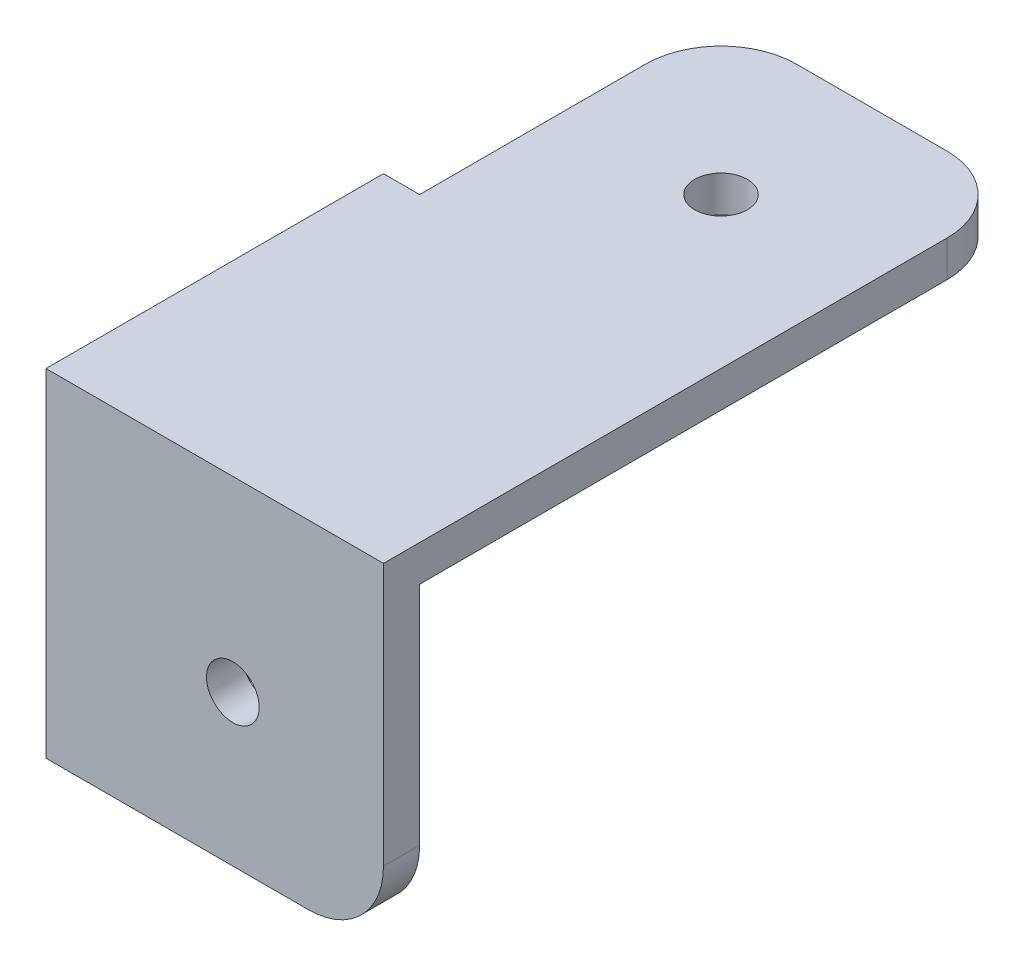
ISO-10303-21;
HEADER;
FILE_DESCRIPTION(('STEP AP214'),'2;1');
FILE_NAME('part.step','',(''),(''),'','','');
FILE_SCHEMA(('AUTOMOTIVE_DESIGN { 1 0 10303 214 1 1 1 1 }'));
ENDSEC;
DATA;
#1=APPLICATION_CONTEXT('core data for automotive mechanical design processes');
#2=APPLICATION_PROTOCOL_DEFINITION('international standard','automotive_design',2000,#1);
#3=PRODUCT_CONTEXT('',#1,'mechanical');
#4=PRODUCT('Part','Part','',(#3));
#5=PRODUCT_RELATED_PRODUCT_CATEGORY('part','',(#4));
#6=PRODUCT_DEFINITION_FORMATION('','',#4);
#7=PRODUCT_DEFINITION_CONTEXT('part definition',#1,'design');
#8=PRODUCT_DEFINITION('design','',#6,#7);
#9=PRODUCT_DEFINITION_SHAPE('','',#8);
#10=(LENGTH_UNIT() NAMED_UNIT(*) SI_UNIT(.MILLI.,.METRE.));
#11=(NAMED_UNIT(*) PLANE_ANGLE_UNIT() SI_UNIT($,.RADIAN.));
#12=(NAMED_UNIT(*) SI_UNIT($,.STERADIAN.) SOLID_ANGLE_UNIT());
#13=UNCERTAINTY_MEASURE_WITH_UNIT(LENGTH_MEASURE(1.E-05),#10,'distance_accuracy_value','');
#14=(GEOMETRIC_REPRESENTATION_CONTEXT(3) GLOBAL_UNCERTAINTY_ASSIGNED_CONTEXT((#13)) GLOBAL_UNIT_ASSIGNED_CONTEXT((#10,
#11,#12)) REPRESENTATION_CONTEXT('',''));
#15=CARTESIAN_POINT('',(0.,0.,0.));
#16=DIRECTION('',(0.,0.,1.));
#17=DIRECTION('',(1.,0.,0.));
#18=AXIS2_PLACEMENT_3D('',#15,#16,#17);
#19=CARTESIAN_POINT('',(-2.4,-20.,0.));
#20=DIRECTION('',(1.,0.,0.));
#21=DIRECTION('',(0.,0.,-1.));
#22=AXIS2_PLACEMENT_3D('',#19,#20,#21);
#23=PLANE('',#22);
#24=CARTESIAN_POINT('',(-2.4,-10.,-10.));
#25=DIRECTION('',(1.,0.,0.));
#26=DIRECTION('',(0.,0.,-1.));
#27=AXIS2_PLACEMENT_3D('',#24,#25,#26);
#28=CIRCLE('',#27,1.75);
#29=CARTESIAN_POINT('',(-2.4,-10.,-11.75));
#30=VERTEX_POINT('',#29);
#31=EDGE_CURVE('E157',#30,#30,#28,.F.);
#32=ORIENTED_EDGE('',*,*,#31,.F.);
#33=EDGE_LOOP('',(#32));
#34=FACE_BOUND('',#33,.T.);
#35=DIRECTION('',(0.,1.,0.));
#36=VECTOR('',#35,1.);
#37=CARTESIAN_POINT('',(-2.4,-20.,-20.));
#38=LINE('',#37,#36);
#39=CARTESIAN_POINT('',(-2.4,-15.,-20.));
#40=VERTEX_POINT('',#39);
#41=CARTESIAN_POINT('',(-2.4,2.4,-20.));
#42=VERTEX_POINT('',#41);
#43=EDGE_CURVE('E190',#40,#42,#38,.T.);
#44=ORIENTED_EDGE('',*,*,#43,.F.);
#45=CARTESIAN_POINT('',(-2.4,-15.,-15.));
#46=DIRECTION('',(1.,0.,0.));
#47=DIRECTION('',(0.,0.,-1.));
#48=AXIS2_PLACEMENT_3D('',#45,#46,#47);
#49=CIRCLE('',#48,5.);
#50=CARTESIAN_POINT('',(-2.4,-20.,-15.));
#51=VERTEX_POINT('',#50);
#52=EDGE_CURVE('E216',#40,#51,#49,.F.);
#53=ORIENTED_EDGE('',*,*,#52,.T.);
#54=DIRECTION('',(0.,0.,-1.));
#55=VECTOR('',#54,1.);
#56=CARTESIAN_POINT('',(-2.4,-20.,0.));
#57=LINE('',#56,#55);
#58=CARTESIAN_POINT('',(-2.4,-20.,2.4));
#59=VERTEX_POINT('',#58);
#60=EDGE_CURVE('E174',#59,#51,#57,.T.);
#61=ORIENTED_EDGE('',*,*,#60,.F.);
#62=DIRECTION('',(0.,1.,0.));
#63=VECTOR('',#62,1.);
#64=CARTESIAN_POINT('',(-2.4,-20.,2.4));
#65=LINE('',#64,#63);
#66=CARTESIAN_POINT('',(-2.4,2.4,2.4));
#67=VERTEX_POINT('',#66);
#68=EDGE_CURVE('E136',#59,#67,#65,.T.);
#69=ORIENTED_EDGE('',*,*,#68,.T.);
#70=DIRECTION('',(0.,0.,1.));
#71=VECTOR('',#70,1.);
#72=CARTESIAN_POINT('',(-2.4,2.4,-20.));
#73=LINE('',#72,#71);
#74=EDGE_CURVE('E151',#42,#67,#73,.T.);
#75=ORIENTED_EDGE('',*,*,#74,.F.);
#76=EDGE_LOOP('',(#44,#53,#61,#69,#75));
#77=FACE_BOUND('',#76,.T.);
#78=ADVANCED_FACE('F33',(#34,#77),#23,.F.);
#79=CARTESIAN_POINT('',(0.,-20.,-20.));
#80=DIRECTION('',(0.,0.,-1.));
#81=DIRECTION('',(-1.,0.,0.));
#82=AXIS2_PLACEMENT_3D('',#79,#80,#81);
#83=PLANE('',#82);
#84=DIRECTION('',(0.,1.,0.));
#85=VECTOR('',#84,1.);
#86=CARTESIAN_POINT('',(0.,-20.,-20.));
#87=LINE('',#86,#85);
#88=CARTESIAN_POINT('',(0.,-15.,-20.));
#89=VERTEX_POINT('',#88);
#90=CARTESIAN_POINT('',(0.,0.,-20.));
#91=VERTEX_POINT('',#90);
#92=EDGE_CURVE('E193',#89,#91,#87,.T.);
#93=ORIENTED_EDGE('',*,*,#92,.F.);
#94=DIRECTION('',(-1.,0.,0.));
#95=VECTOR('',#94,1.);
#96=CARTESIAN_POINT('',(-2.4,-15.,-20.));
#97=LINE('',#96,#95);
#98=EDGE_CURVE('E213',#89,#40,#97,.T.);
#99=ORIENTED_EDGE('',*,*,#98,.T.);
#100=ORIENTED_EDGE('',*,*,#43,.T.);
#101=DIRECTION('',(-1.,0.,0.));
#102=VECTOR('',#101,1.);
#103=CARTESIAN_POINT('',(0.,2.4,-20.));
#104=LINE('',#103,#102);
#105=CARTESIAN_POINT('',(0.,2.4,-20.));
#106=VERTEX_POINT('',#105);
#107=EDGE_CURVE('E163',#106,#42,#104,.T.);
#108=ORIENTED_EDGE('',*,*,#107,.F.);
#109=DIRECTION('',(0.,-1.,0.));
#110=VECTOR('',#109,1.);
#111=CARTESIAN_POINT('',(0.,2.4,-20.));
#112=LINE('',#111,#110);
#113=EDGE_CURVE('E166',#106,#91,#112,.T.);
#114=ORIENTED_EDGE('',*,*,#113,.T.);
#115=EDGE_LOOP('',(#93,#99,#100,#108,#114));
#116=FACE_BOUND('',#115,.T.);
#117=ADVANCED_FACE('F251',(#116),#83,.T.);
#118=CARTESIAN_POINT('',(0.,-20.,0.));
#119=DIRECTION('',(1.,0.,0.));
#120=DIRECTION('',(0.,0.,-1.));
#121=AXIS2_PLACEMENT_3D('',#118,#119,#120);
#122=PLANE('',#121);
#123=CARTESIAN_POINT('',(0.,-10.,-10.));
#124=DIRECTION('',(1.,0.,0.));
#125=DIRECTION('',(0.,0.,-1.));
#126=AXIS2_PLACEMENT_3D('',#123,#124,#125);
#127=CIRCLE('',#126,1.75);
#128=CARTESIAN_POINT('',(0.,-10.,-11.75));
#129=VERTEX_POINT('',#128);
#130=EDGE_CURVE('E350',#129,#129,#127,.T.);
#131=ORIENTED_EDGE('',*,*,#130,.F.);
#132=EDGE_LOOP('',(#131));
#133=FACE_BOUND('',#132,.T.);
#134=DIRECTION('',(0.,0.,-1.));
#135=VECTOR('',#134,1.);
#136=CARTESIAN_POINT('',(0.,-20.,0.));
#137=LINE('',#136,#135);
#138=CARTESIAN_POINT('',(0.,-20.,0.));
#139=VERTEX_POINT('',#138);
#140=CARTESIAN_POINT('',(0.,-20.,-15.));
#141=VERTEX_POINT('',#140);
#142=EDGE_CURVE('E183',#139,#141,#137,.T.);
#143=ORIENTED_EDGE('',*,*,#142,.T.);
#144=CARTESIAN_POINT('',(0.,-15.,-15.));
#145=DIRECTION('',(1.,0.,0.));
#146=DIRECTION('',(0.,0.,-1.));
#147=AXIS2_PLACEMENT_3D('',#144,#145,#146);
#148=CIRCLE('',#147,5.);
#149=EDGE_CURVE('E218',#141,#89,#148,.T.);
#150=ORIENTED_EDGE('',*,*,#149,.T.);
#151=ORIENTED_EDGE('',*,*,#92,.T.);
#152=DIRECTION('',(0.,0.,-1.));
#153=VECTOR('',#152,1.);
#154=CARTESIAN_POINT('',(0.,0.,0.));
#155=LINE('',#154,#153);
#156=CARTESIAN_POINT('',(0.,0.,0.));
#157=VERTEX_POINT('',#156);
#158=EDGE_CURVE('E178',#157,#91,#155,.T.);
#159=ORIENTED_EDGE('',*,*,#158,.F.);
#160=DIRECTION('',(0.,1.,0.));
#161=VECTOR('',#160,1.);
#162=CARTESIAN_POINT('',(0.,-20.,0.));
#163=LINE('',#162,#161);
#164=EDGE_CURVE('E196',#139,#157,#163,.T.);
#165=ORIENTED_EDGE('',*,*,#164,.F.);
#166=EDGE_LOOP('',(#143,#150,#151,#159,#165));
#167=FACE_BOUND('',#166,.T.);
#168=ADVANCED_FACE('F255',(#133,#167),#122,.T.);
#169=CARTESIAN_POINT('',(0.,-20.,0.));
#170=DIRECTION('',(0.,0.,1.));
#171=DIRECTION('',(1.,0.,0.));
#172=AXIS2_PLACEMENT_3D('',#169,#170,#171);
#173=PLANE('',#172);
#174=CARTESIAN_POINT('',(10.,-10.,0.));
#175=DIRECTION('',(0.,0.,-1.));
#176=DIRECTION('',(-1.,0.,0.));
#177=AXIS2_PLACEMENT_3D('',#174,#175,#176);
#178=CIRCLE('',#177,1.75);
#179=CARTESIAN_POINT('',(8.25,-10.,0.));
#180=VERTEX_POINT('',#179);
#181=EDGE_CURVE('E343',#180,#180,#178,.T.);
#182=ORIENTED_EDGE('',*,*,#181,.F.);
#183=EDGE_LOOP('',(#182));
#184=FACE_BOUND('',#183,.T.);
#185=DIRECTION('',(0.,1.,0.));
#186=VECTOR('',#185,1.);
#187=CARTESIAN_POINT('',(20.,-20.,0.));
#188=LINE('',#187,#186);
#189=CARTESIAN_POINT('',(20.,-15.,0.));
#190=VERTEX_POINT('',#189);
#191=CARTESIAN_POINT('',(20.,0.,0.));
#192=VERTEX_POINT('',#191);
#193=EDGE_CURVE('E135',#190,#192,#188,.T.);
#194=ORIENTED_EDGE('',*,*,#193,.F.);
#195=CARTESIAN_POINT('',(15.,-15.,0.));
#196=DIRECTION('',(0.,0.,1.));
#197=DIRECTION('',(1.,0.,0.));
#198=AXIS2_PLACEMENT_3D('',#195,#196,#197);
#199=CIRCLE('',#198,5.);
#200=CARTESIAN_POINT('',(15.,-20.,0.));
#201=VERTEX_POINT('',#200);
#202=EDGE_CURVE('E211',#190,#201,#199,.F.);
#203=ORIENTED_EDGE('',*,*,#202,.T.);
#204=DIRECTION('',(1.,0.,0.));
#205=VECTOR('',#204,1.);
#206=CARTESIAN_POINT('',(0.,-20.,0.));
#207=LINE('',#206,#205);
#208=EDGE_CURVE('E180',#139,#201,#207,.T.);
#209=ORIENTED_EDGE('',*,*,#208,.F.);
#210=ORIENTED_EDGE('',*,*,#164,.T.);
#211=DIRECTION('',(1.,0.,0.));
#212=VECTOR('',#211,1.);
#213=CARTESIAN_POINT('',(0.,0.,0.));
#214=LINE('',#213,#212);
#215=EDGE_CURVE('E173',#157,#192,#214,.T.);
#216=ORIENTED_EDGE('',*,*,#215,.T.);
#217=EDGE_LOOP('',(#194,#203,#209,#210,#216));
#218=FACE_BOUND('',#217,.T.);
#219=ADVANCED_FACE('F242',(#184,#218),#173,.F.);
#220=CARTESIAN_POINT('',(20.,-20.,0.));
#221=DIRECTION('',(-1.,0.,0.));
#222=DIRECTION('',(0.,0.,1.));
#223=AXIS2_PLACEMENT_3D('',#220,#221,#222);
#224=PLANE('',#223);
#225=DIRECTION('',(0.,1.,0.));
#226=VECTOR('',#225,1.);
#227=CARTESIAN_POINT('',(20.,-20.,2.4));
#228=LINE('',#227,#226);
#229=CARTESIAN_POINT('',(20.,-15.,2.4));
#230=VERTEX_POINT('',#229);
#231=CARTESIAN_POINT('',(20.,2.4,2.4));
#232=VERTEX_POINT('',#231);
#233=EDGE_CURVE('E126',#230,#232,#228,.T.);
#234=ORIENTED_EDGE('',*,*,#233,.F.);
#235=DIRECTION('',(0.,0.,1.));
#236=VECTOR('',#235,1.);
#237=CARTESIAN_POINT('',(20.,-15.,0.));
#238=LINE('',#237,#236);
#239=EDGE_CURVE('E209',#230,#190,#238,.F.);
#240=ORIENTED_EDGE('',*,*,#239,.T.);
#241=ORIENTED_EDGE('',*,*,#193,.T.);
#242=DIRECTION('',(0.,0.,-1.));
#243=VECTOR('',#242,1.);
#244=CARTESIAN_POINT('',(20.,0.,2.4));
#245=LINE('',#244,#243);
#246=CARTESIAN_POINT('',(20.,0.,-35.));
#247=VERTEX_POINT('',#246);
#248=EDGE_CURVE('E167',#192,#247,#245,.T.);
#249=ORIENTED_EDGE('',*,*,#248,.T.);
#250=DIRECTION('',(0.,-1.,0.));
#251=VECTOR('',#250,1.);
#252=CARTESIAN_POINT('',(20.,-20.,-35.));
#253=LINE('',#252,#251);
#254=CARTESIAN_POINT('',(20.,2.4,-35.));
#255=VERTEX_POINT('',#254);
#256=EDGE_CURVE('E143',#247,#255,#253,.F.);
#257=ORIENTED_EDGE('',*,*,#256,.T.);
#258=DIRECTION('',(0.,0.,-1.));
#259=VECTOR('',#258,1.);
#260=CARTESIAN_POINT('',(20.,2.4,2.4));
#261=LINE('',#260,#259);
#262=EDGE_CURVE('E139',#232,#255,#261,.T.);
#263=ORIENTED_EDGE('',*,*,#262,.F.);
#264=EDGE_LOOP('',(#234,#240,#241,#249,#257,#263));
#265=FACE_BOUND('',#264,.T.);
#266=ADVANCED_FACE('F140',(#265),#224,.F.);
#267=CARTESIAN_POINT('',(0.,-20.,2.4));
#268=DIRECTION('',(0.,0.,1.));
#269=DIRECTION('',(1.,0.,0.));
#270=AXIS2_PLACEMENT_3D('',#267,#268,#269);
#271=PLANE('',#270);
#272=CARTESIAN_POINT('',(10.,-10.,2.4));
#273=DIRECTION('',(0.,0.,1.));
#274=DIRECTION('',(1.,0.,0.));
#275=AXIS2_PLACEMENT_3D('',#272,#273,#274);
#276=CIRCLE('',#275,1.75);
#277=CARTESIAN_POINT('',(11.75,-10.,2.4));
#278=VERTEX_POINT('',#277);
#279=EDGE_CURVE('E339',#278,#278,#276,.F.);
#280=ORIENTED_EDGE('',*,*,#279,.T.);
#281=EDGE_LOOP('',(#280));
#282=FACE_BOUND('',#281,.T.);
#283=DIRECTION('',(1.,0.,0.));
#284=VECTOR('',#283,1.);
#285=CARTESIAN_POINT('',(0.,-20.,2.4));
#286=LINE('',#285,#284);
#287=CARTESIAN_POINT('',(15.,-20.,2.4));
#288=VERTEX_POINT('',#287);
#289=EDGE_CURVE('E177',#59,#288,#286,.T.);
#290=ORIENTED_EDGE('',*,*,#289,.T.);
#291=CARTESIAN_POINT('',(15.,-15.,2.4));
#292=DIRECTION('',(0.,0.,1.));
#293=DIRECTION('',(1.,0.,0.));
#294=AXIS2_PLACEMENT_3D('',#291,#292,#293);
#295=CIRCLE('',#294,5.);
#296=EDGE_CURVE('E132',#288,#230,#295,.T.);
#297=ORIENTED_EDGE('',*,*,#296,.T.);
#298=ORIENTED_EDGE('',*,*,#233,.T.);
#299=DIRECTION('',(1.,0.,0.));
#300=VECTOR('',#299,1.);
#301=CARTESIAN_POINT('',(-2.4,2.4,2.4));
#302=LINE('',#301,#300);
#303=EDGE_CURVE('E131',#67,#232,#302,.T.);
#304=ORIENTED_EDGE('',*,*,#303,.F.);
#305=ORIENTED_EDGE('',*,*,#68,.F.);
#306=EDGE_LOOP('',(#290,#297,#298,#304,#305));
#307=FACE_BOUND('',#306,.T.);
#308=ADVANCED_FACE('F129',(#282,#307),#271,.T.);
#309=CARTESIAN_POINT('',(0.,-20.,0.));
#310=DIRECTION('',(0.,1.,0.));
#311=DIRECTION('',(0.,0.,1.));
#312=AXIS2_PLACEMENT_3D('',#309,#310,#311);
#313=PLANE('',#312);
#314=ORIENTED_EDGE('',*,*,#208,.T.);
#315=DIRECTION('',(0.,0.,1.));
#316=VECTOR('',#315,1.);
#317=CARTESIAN_POINT('',(15.,-20.,0.));
#318=LINE('',#317,#316);
#319=EDGE_CURVE('E204',#201,#288,#318,.T.);
#320=ORIENTED_EDGE('',*,*,#319,.T.);
#321=ORIENTED_EDGE('',*,*,#289,.F.);
#322=ORIENTED_EDGE('',*,*,#60,.T.);
#323=DIRECTION('',(-1.,0.,0.));
#324=VECTOR('',#323,1.);
#325=CARTESIAN_POINT('',(0.,-20.,-15.));
#326=LINE('',#325,#324);
#327=EDGE_CURVE('E202',#51,#141,#326,.F.);
#328=ORIENTED_EDGE('',*,*,#327,.T.);
#329=ORIENTED_EDGE('',*,*,#142,.F.);
#330=EDGE_LOOP('',(#314,#320,#321,#322,#328,#329));
#331=FACE_BOUND('',#330,.T.);
#332=ADVANCED_FACE('F266',(#331),#313,.F.);
#333=CARTESIAN_POINT('',(20.,2.4,-40.));
#334=DIRECTION('',(0.,0.,1.));
#335=DIRECTION('',(1.,0.,0.));
#336=AXIS2_PLACEMENT_3D('',#333,#334,#335);
#337=PLANE('',#336);
#338=DIRECTION('',(-1.,0.,0.));
#339=VECTOR('',#338,1.);
#340=CARTESIAN_POINT('',(20.,2.4,-40.));
#341=LINE('',#340,#339);
#342=CARTESIAN_POINT('',(15.,2.4,-40.));
#343=VERTEX_POINT('',#342);
#344=CARTESIAN_POINT('',(5.,2.4,-40.));
#345=VERTEX_POINT('',#344);
#346=EDGE_CURVE('E145',#343,#345,#341,.T.);
#347=ORIENTED_EDGE('',*,*,#346,.F.);
#348=DIRECTION('',(0.,-1.,0.));
#349=VECTOR('',#348,1.);
#350=CARTESIAN_POINT('',(15.,2.4,-40.));
#351=LINE('',#350,#349);
#352=CARTESIAN_POINT('',(15.,0.,-40.));
#353=VERTEX_POINT('',#352);
#354=EDGE_CURVE('E222',#343,#353,#351,.T.);
#355=ORIENTED_EDGE('',*,*,#354,.T.);
#356=DIRECTION('',(-1.,0.,0.));
#357=VECTOR('',#356,1.);
#358=CARTESIAN_POINT('',(20.,0.,-40.));
#359=LINE('',#358,#357);
#360=CARTESIAN_POINT('',(5.,0.,-40.));
#361=VERTEX_POINT('',#360);
#362=EDGE_CURVE('E154',#353,#361,#359,.T.);
#363=ORIENTED_EDGE('',*,*,#362,.T.);
#364=DIRECTION('',(0.,-1.,0.));
#365=VECTOR('',#364,1.);
#366=CARTESIAN_POINT('',(5.,2.4,-40.));
#367=LINE('',#366,#365);
#368=EDGE_CURVE('E220',#361,#345,#367,.F.);
#369=ORIENTED_EDGE('',*,*,#368,.T.);
#370=EDGE_LOOP('',(#347,#355,#363,#369));
#371=FACE_BOUND('',#370,.T.);
#372=ADVANCED_FACE('F232',(#371),#337,.F.);
#373=CARTESIAN_POINT('',(0.,2.4,-40.));
#374=DIRECTION('',(1.,0.,0.));
#375=DIRECTION('',(0.,0.,-1.));
#376=AXIS2_PLACEMENT_3D('',#373,#374,#375);
#377=PLANE('',#376);
#378=DIRECTION('',(0.,0.,1.));
#379=VECTOR('',#378,1.);
#380=CARTESIAN_POINT('',(0.,2.4,-40.));
#381=LINE('',#380,#379);
#382=CARTESIAN_POINT('',(0.,2.4,-35.));
#383=VERTEX_POINT('',#382);
#384=EDGE_CURVE('E161',#383,#106,#381,.T.);
#385=ORIENTED_EDGE('',*,*,#384,.F.);
#386=DIRECTION('',(0.,-1.,0.));
#387=VECTOR('',#386,1.);
#388=CARTESIAN_POINT('',(0.,2.4,-35.));
#389=LINE('',#388,#387);
#390=CARTESIAN_POINT('',(0.,0.,-35.));
#391=VERTEX_POINT('',#390);
#392=EDGE_CURVE('E11',#383,#391,#389,.T.);
#393=ORIENTED_EDGE('',*,*,#392,.T.);
#394=DIRECTION('',(0.,0.,1.));
#395=VECTOR('',#394,1.);
#396=CARTESIAN_POINT('',(0.,0.,-40.));
#397=LINE('',#396,#395);
#398=EDGE_CURVE('E152',#391,#91,#397,.T.);
#399=ORIENTED_EDGE('',*,*,#398,.T.);
#400=ORIENTED_EDGE('',*,*,#113,.F.);
#401=EDGE_LOOP('',(#385,#393,#399,#400));
#402=FACE_BOUND('',#401,.T.);
#403=ADVANCED_FACE('F254',(#402),#377,.F.);
#404=CARTESIAN_POINT('',(0.,2.4,0.));
#405=DIRECTION('',(0.,1.,0.));
#406=DIRECTION('',(0.,0.,1.));
#407=AXIS2_PLACEMENT_3D('',#404,#405,#406);
#408=PLANE('',#407);
#409=CARTESIAN_POINT('',(10.,2.4,-30.));
#410=DIRECTION('',(0.,1.,0.));
#411=DIRECTION('',(0.,0.,1.));
#412=AXIS2_PLACEMENT_3D('',#409,#410,#411);
#413=CIRCLE('',#412,1.75);
#414=CARTESIAN_POINT('',(10.,2.4,-28.25));
#415=VERTEX_POINT('',#414);
#416=EDGE_CURVE('E340',#415,#415,#413,.T.);
#417=ORIENTED_EDGE('',*,*,#416,.F.);
#418=EDGE_LOOP('',(#417));
#419=FACE_BOUND('',#418,.T.);
#420=ORIENTED_EDGE('',*,*,#262,.T.);
#421=CARTESIAN_POINT('',(15.,2.4,-35.));
#422=DIRECTION('',(0.,1.,0.));
#423=DIRECTION('',(0.,0.,1.));
#424=AXIS2_PLACEMENT_3D('',#421,#422,#423);
#425=CIRCLE('',#424,5.);
#426=EDGE_CURVE('E41',#255,#343,#425,.T.);
#427=ORIENTED_EDGE('',*,*,#426,.T.);
#428=ORIENTED_EDGE('',*,*,#346,.T.);
#429=CARTESIAN_POINT('',(5.,2.4,-35.));
#430=DIRECTION('',(0.,1.,0.));
#431=DIRECTION('',(0.,0.,1.));
#432=AXIS2_PLACEMENT_3D('',#429,#430,#431);
#433=CIRCLE('',#432,5.);
#434=EDGE_CURVE('E48',#345,#383,#433,.T.);
#435=ORIENTED_EDGE('',*,*,#434,.T.);
#436=ORIENTED_EDGE('',*,*,#384,.T.);
#437=ORIENTED_EDGE('',*,*,#107,.T.);
#438=ORIENTED_EDGE('',*,*,#74,.T.);
#439=ORIENTED_EDGE('',*,*,#303,.T.);
#440=EDGE_LOOP('',(#420,#427,#428,#435,#436,#437,#438,#439));
#441=FACE_BOUND('',#440,.T.);
#442=ADVANCED_FACE('F148',(#419,#441),#408,.T.);
#443=CARTESIAN_POINT('',(0.,0.,0.));
#444=DIRECTION('',(0.,1.,0.));
#445=DIRECTION('',(0.,0.,1.));
#446=AXIS2_PLACEMENT_3D('',#443,#444,#445);
#447=PLANE('',#446);
#448=CARTESIAN_POINT('',(10.,0.,-10.));
#449=DIRECTION('',(0.,1.,0.));
#450=DIRECTION('',(0.,0.,1.));
#451=AXIS2_PLACEMENT_3D('',#448,#449,#450);
#452=CIRCLE('',#451,2.);
#453=CARTESIAN_POINT('',(10.,0.,-8.));
#454=VERTEX_POINT('',#453);
#455=EDGE_CURVE('E192',#454,#454,#452,.F.);
#456=ORIENTED_EDGE('',*,*,#455,.F.);
#457=EDGE_LOOP('',(#456));
#458=FACE_BOUND('',#457,.T.);
#459=CARTESIAN_POINT('',(10.,0.,-30.));
#460=DIRECTION('',(0.,1.,0.));
#461=DIRECTION('',(0.,0.,1.));
#462=AXIS2_PLACEMENT_3D('',#459,#460,#461);
#463=CIRCLE('',#462,1.75);
#464=CARTESIAN_POINT('',(10.,0.,-28.25));
#465=VERTEX_POINT('',#464);
#466=EDGE_CURVE('E337',#465,#465,#463,.F.);
#467=ORIENTED_EDGE('',*,*,#466,.F.);
#468=EDGE_LOOP('',(#467));
#469=FACE_BOUND('',#468,.T.);
#470=ORIENTED_EDGE('',*,*,#362,.F.);
#471=CARTESIAN_POINT('',(15.,0.,-35.));
#472=DIRECTION('',(0.,1.,0.));
#473=DIRECTION('',(0.,0.,1.));
#474=AXIS2_PLACEMENT_3D('',#471,#472,#473);
#475=CIRCLE('',#474,5.);
#476=EDGE_CURVE('E226',#353,#247,#475,.F.);
#477=ORIENTED_EDGE('',*,*,#476,.T.);
#478=ORIENTED_EDGE('',*,*,#248,.F.);
#479=ORIENTED_EDGE('',*,*,#215,.F.);
#480=ORIENTED_EDGE('',*,*,#158,.T.);
#481=ORIENTED_EDGE('',*,*,#398,.F.);
#482=CARTESIAN_POINT('',(5.,0.,-35.));
#483=DIRECTION('',(0.,1.,0.));
#484=DIRECTION('',(0.,0.,1.));
#485=AXIS2_PLACEMENT_3D('',#482,#483,#484);
#486=CIRCLE('',#485,5.);
#487=EDGE_CURVE('E56',#391,#361,#486,.F.);
#488=ORIENTED_EDGE('',*,*,#487,.T.);
#489=EDGE_LOOP('',(#470,#477,#478,#479,#480,#481,#488));
#490=FACE_BOUND('',#489,.T.);
#491=ADVANCED_FACE('F237',(#458,#469,#490),#447,.F.);
#492=CARTESIAN_POINT('',(-2.401,-10.,-10.));
#493=DIRECTION('',(1.,0.,0.));
#494=DIRECTION('',(0.,0.,-1.));
#495=AXIS2_PLACEMENT_3D('',#492,#493,#494);
#496=CYLINDRICAL_SURFACE('',#495,1.75);
#497=ORIENTED_EDGE('',*,*,#130,.T.);
#498=EDGE_LOOP('',(#497));
#499=FACE_BOUND('',#498,.T.);
#500=ORIENTED_EDGE('',*,*,#31,.T.);
#501=EDGE_LOOP('',(#500));
#502=FACE_BOUND('',#501,.T.);
#503=ADVANCED_FACE('F309',(#499,#502),#496,.F.);
#504=CARTESIAN_POINT('',(10.,-10.,2.401));
#505=DIRECTION('',(0.,0.,-1.));
#506=DIRECTION('',(-1.,0.,0.));
#507=AXIS2_PLACEMENT_3D('',#504,#505,#506);
#508=CYLINDRICAL_SURFACE('',#507,1.75);
#509=ORIENTED_EDGE('',*,*,#279,.F.);
#510=EDGE_LOOP('',(#509));
#511=FACE_BOUND('',#510,.T.);
#512=ORIENTED_EDGE('',*,*,#181,.T.);
#513=EDGE_LOOP('',(#512));
#514=FACE_BOUND('',#513,.T.);
#515=ADVANCED_FACE('F316',(#511,#514),#508,.F.);
#516=CARTESIAN_POINT('',(10.,-20.001,-30.));
#517=DIRECTION('',(0.,1.,0.));
#518=DIRECTION('',(0.,0.,1.));
#519=AXIS2_PLACEMENT_3D('',#516,#517,#518);
#520=CYLINDRICAL_SURFACE('',#519,1.75);
#521=ORIENTED_EDGE('',*,*,#416,.T.);
#522=EDGE_LOOP('',(#521));
#523=FACE_BOUND('',#522,.T.);
#524=ORIENTED_EDGE('',*,*,#466,.T.);
#525=EDGE_LOOP('',(#524));
#526=FACE_BOUND('',#525,.T.);
#527=ADVANCED_FACE('F320',(#523,#526),#520,.F.);
#528=CARTESIAN_POINT('',(10.,-5.,-10.));
#529=DIRECTION('',(0.,1.,0.));
#530=DIRECTION('',(0.,0.,1.));
#531=AXIS2_PLACEMENT_3D('',#528,#529,#530);
#532=CYLINDRICAL_SURFACE('',#531,2.);
#533=CARTESIAN_POINT('',(10.,-5.,-10.));
#534=DIRECTION('',(0.,-1.,0.));
#535=DIRECTION('',(0.,0.,-1.));
#536=AXIS2_PLACEMENT_3D('',#533,#534,#535);
#537=CIRCLE('',#536,2.);
#538=CARTESIAN_POINT('',(10.,-5.,-12.));
#539=VERTEX_POINT('',#538);
#540=EDGE_CURVE('E332',#539,#539,#537,.T.);
#541=ORIENTED_EDGE('',*,*,#540,.F.);
#542=EDGE_LOOP('',(#541));
#543=FACE_BOUND('',#542,.T.);
#544=ORIENTED_EDGE('',*,*,#455,.T.);
#545=EDGE_LOOP('',(#544));
#546=FACE_BOUND('',#545,.T.);
#547=ADVANCED_FACE('F278',(#543,#546),#532,.T.);
#548=CARTESIAN_POINT('',(10.,-5.,-10.));
#549=DIRECTION('',(0.,-1.,0.));
#550=DIRECTION('',(0.,0.,-1.));
#551=AXIS2_PLACEMENT_3D('',#548,#549,#550);
#552=PLANE('',#551);
#553=ORIENTED_EDGE('',*,*,#540,.T.);
#554=EDGE_LOOP('',(#553));
#555=FACE_BOUND('',#554,.T.);
#556=ADVANCED_FACE('F271',(#555),#552,.T.);
#557=CARTESIAN_POINT('',(15.,-15.,0.));
#558=DIRECTION('',(0.,0.,1.));
#559=DIRECTION('',(1.,0.,0.));
#560=AXIS2_PLACEMENT_3D('',#557,#558,#559);
#561=CYLINDRICAL_SURFACE('',#560,5.);
#562=ORIENTED_EDGE('',*,*,#202,.F.);
#563=ORIENTED_EDGE('',*,*,#239,.F.);
#564=ORIENTED_EDGE('',*,*,#296,.F.);
#565=ORIENTED_EDGE('',*,*,#319,.F.);
#566=EDGE_LOOP('',(#562,#563,#564,#565));
#567=FACE_BOUND('',#566,.T.);
#568=ADVANCED_FACE('F269',(#567),#561,.T.);
#569=CARTESIAN_POINT('',(0.,-15.,-15.));
#570=DIRECTION('',(1.,0.,0.));
#571=DIRECTION('',(0.,0.,-1.));
#572=AXIS2_PLACEMENT_3D('',#569,#570,#571);
#573=CYLINDRICAL_SURFACE('',#572,5.);
#574=ORIENTED_EDGE('',*,*,#149,.F.);
#575=ORIENTED_EDGE('',*,*,#327,.F.);
#576=ORIENTED_EDGE('',*,*,#52,.F.);
#577=ORIENTED_EDGE('',*,*,#98,.F.);
#578=EDGE_LOOP('',(#574,#575,#576,#577));
#579=FACE_BOUND('',#578,.T.);
#580=ADVANCED_FACE('F260',(#579),#573,.T.);
#581=CARTESIAN_POINT('',(15.,2.4,-35.));
#582=DIRECTION('',(0.,-1.,0.));
#583=DIRECTION('',(0.,0.,-1.));
#584=AXIS2_PLACEMENT_3D('',#581,#582,#583);
#585=CYLINDRICAL_SURFACE('',#584,5.);
#586=ORIENTED_EDGE('',*,*,#426,.F.);
#587=ORIENTED_EDGE('',*,*,#256,.F.);
#588=ORIENTED_EDGE('',*,*,#476,.F.);
#589=ORIENTED_EDGE('',*,*,#354,.F.);
#590=EDGE_LOOP('',(#586,#587,#588,#589));
#591=FACE_BOUND('',#590,.T.);
#592=ADVANCED_FACE('F234',(#591),#585,.T.);
#593=CARTESIAN_POINT('',(5.,2.4,-35.));
#594=DIRECTION('',(0.,-1.,0.));
#595=DIRECTION('',(0.,0.,-1.));
#596=AXIS2_PLACEMENT_3D('',#593,#594,#595);
#597=CYLINDRICAL_SURFACE('',#596,5.);
#598=ORIENTED_EDGE('',*,*,#434,.F.);
#599=ORIENTED_EDGE('',*,*,#368,.F.);
#600=ORIENTED_EDGE('',*,*,#487,.F.);
#601=ORIENTED_EDGE('',*,*,#392,.F.);
#602=EDGE_LOOP('',(#598,#599,#600,#601));
#603=FACE_BOUND('',#602,.T.);
#604=ADVANCED_FACE('F35',(#603),#597,.T.);
#605=CLOSED_SHELL('',(#78,#117,#168,#219,#266,#308,#332,#372,#403,#442,#491,#503,#515,#527,#547,
#556,#568,#580,#592,#604));
#606=MANIFOLD_SOLID_BREP('B2',#605);
#607=ADVANCED_BREP_SHAPE_REPRESENTATION('',(#18,#606),#14);
#608=SHAPE_DEFINITION_REPRESENTATION(#9,#607);
ENDSEC;
END-ISO-10303-21;
